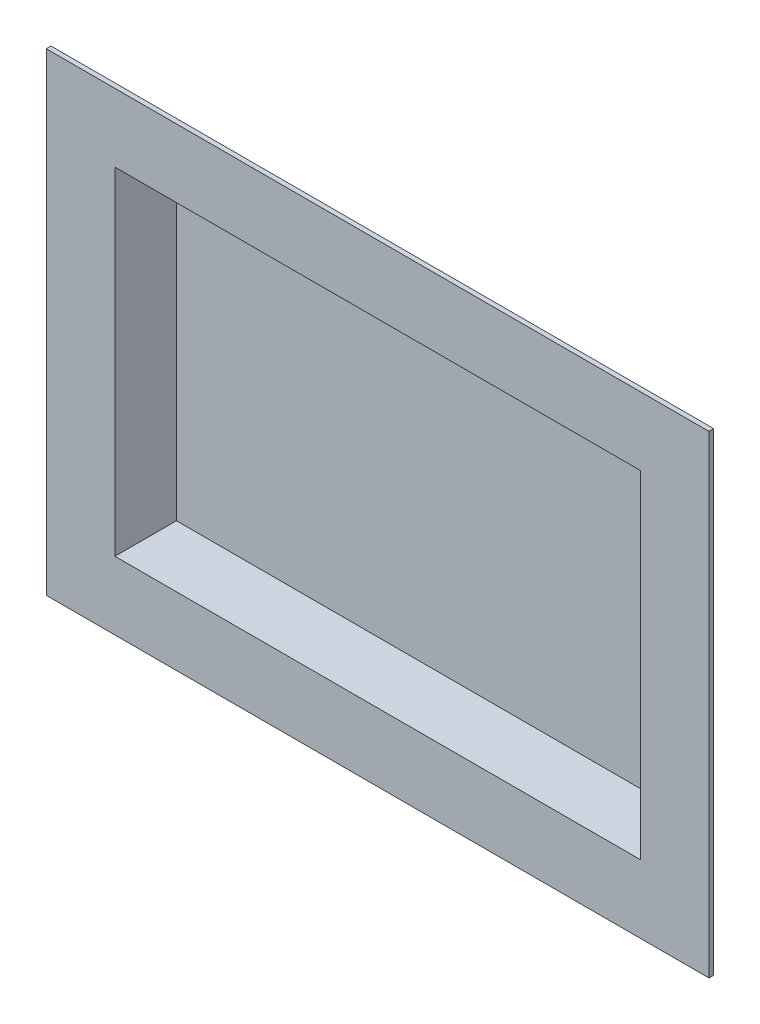
ISO-10303-21;
HEADER;
FILE_DESCRIPTION(('STEP AP214'),'2;1');
FILE_NAME('part.step','',(''),(''),'','','');
FILE_SCHEMA(('AUTOMOTIVE_DESIGN { 1 0 10303 214 1 1 1 1 }'));
ENDSEC;
DATA;
#1=APPLICATION_CONTEXT('core data for automotive mechanical design processes');
#2=APPLICATION_PROTOCOL_DEFINITION('international standard','automotive_design',2000,#1);
#3=PRODUCT_CONTEXT('',#1,'mechanical');
#4=PRODUCT('Part','Part','',(#3));
#5=PRODUCT_RELATED_PRODUCT_CATEGORY('part','',(#4));
#6=PRODUCT_DEFINITION_FORMATION('','',#4);
#7=PRODUCT_DEFINITION_CONTEXT('part definition',#1,'design');
#8=PRODUCT_DEFINITION('design','',#6,#7);
#9=PRODUCT_DEFINITION_SHAPE('','',#8);
#10=(LENGTH_UNIT() NAMED_UNIT(*) SI_UNIT(.MILLI.,.METRE.));
#11=(NAMED_UNIT(*) PLANE_ANGLE_UNIT() SI_UNIT($,.RADIAN.));
#12=(NAMED_UNIT(*) SI_UNIT($,.STERADIAN.) SOLID_ANGLE_UNIT());
#13=UNCERTAINTY_MEASURE_WITH_UNIT(LENGTH_MEASURE(1.E-05),#10,'distance_accuracy_value','');
#14=(GEOMETRIC_REPRESENTATION_CONTEXT(3) GLOBAL_UNCERTAINTY_ASSIGNED_CONTEXT((#13)) GLOBAL_UNIT_ASSIGNED_CONTEXT((#10,
#11,#12)) REPRESENTATION_CONTEXT('',''));
#15=CARTESIAN_POINT('',(0.,0.,0.));
#16=DIRECTION('',(0.,0.,1.));
#17=DIRECTION('',(1.,0.,0.));
#18=AXIS2_PLACEMENT_3D('',#15,#16,#17);
#19=CARTESIAN_POINT('',(0.,0.,1.27));
#20=DIRECTION('',(0.,0.,-1.));
#21=DIRECTION('',(-1.,0.,0.));
#22=AXIS2_PLACEMENT_3D('',#19,#20,#21);
#23=PLANE('',#22);
#24=DIRECTION('',(0.,1.,0.));
#25=VECTOR('',#24,1.);
#26=CARTESIAN_POINT('',(88.9,-63.5,1.27));
#27=LINE('',#26,#25);
#28=CARTESIAN_POINT('',(88.9,-63.5,1.27));
#29=VERTEX_POINT('',#28);
#30=CARTESIAN_POINT('',(88.9,63.5,1.27));
#31=VERTEX_POINT('',#30);
#32=EDGE_CURVE('E175',#29,#31,#27,.T.);
#33=ORIENTED_EDGE('',*,*,#32,.T.);
#34=DIRECTION('',(-1.,0.,0.));
#35=VECTOR('',#34,1.);
#36=CARTESIAN_POINT('',(-88.9,63.5,1.27));
#37=LINE('',#36,#35);
#38=CARTESIAN_POINT('',(-88.9,63.5,1.27));
#39=VERTEX_POINT('',#38);
#40=EDGE_CURVE('E178',#31,#39,#37,.T.);
#41=ORIENTED_EDGE('',*,*,#40,.T.);
#42=DIRECTION('',(0.,-1.,0.));
#43=VECTOR('',#42,1.);
#44=CARTESIAN_POINT('',(-88.9,-63.5,1.27));
#45=LINE('',#44,#43);
#46=CARTESIAN_POINT('',(-88.9,-63.5,1.27));
#47=VERTEX_POINT('',#46);
#48=EDGE_CURVE('E181',#39,#47,#45,.T.);
#49=ORIENTED_EDGE('',*,*,#48,.T.);
#50=DIRECTION('',(1.,0.,0.));
#51=VECTOR('',#50,1.);
#52=CARTESIAN_POINT('',(-88.9,-63.5,1.27));
#53=LINE('',#52,#51);
#54=EDGE_CURVE('E183',#47,#29,#53,.T.);
#55=ORIENTED_EDGE('',*,*,#54,.T.);
#56=EDGE_LOOP('',(#33,#41,#49,#55));
#57=FACE_BOUND('',#56,.T.);
#58=DIRECTION('',(-1.,0.,0.));
#59=VECTOR('',#58,1.);
#60=CARTESIAN_POINT('',(-71.755,45.212,1.27));
#61=LINE('',#60,#59);
#62=CARTESIAN_POINT('',(70.485,45.212,1.27));
#63=VERTEX_POINT('',#62);
#64=CARTESIAN_POINT('',(-70.485,45.212,1.27));
#65=VERTEX_POINT('',#64);
#66=EDGE_CURVE('E169',#63,#65,#61,.T.);
#67=ORIENTED_EDGE('',*,*,#66,.F.);
#68=DIRECTION('',(0.,1.,0.));
#69=VECTOR('',#68,1.);
#70=CARTESIAN_POINT('',(70.485,-46.482,1.27));
#71=LINE('',#70,#69);
#72=CARTESIAN_POINT('',(70.485,-45.212,1.27));
#73=VERTEX_POINT('',#72);
#74=EDGE_CURVE('E173',#73,#63,#71,.T.);
#75=ORIENTED_EDGE('',*,*,#74,.F.);
#76=DIRECTION('',(1.,0.,0.));
#77=VECTOR('',#76,1.);
#78=CARTESIAN_POINT('',(-71.755,-45.212,1.27));
#79=LINE('',#78,#77);
#80=CARTESIAN_POINT('',(-70.485,-45.212,1.27));
#81=VERTEX_POINT('',#80);
#82=EDGE_CURVE('E141',#81,#73,#79,.T.);
#83=ORIENTED_EDGE('',*,*,#82,.F.);
#84=DIRECTION('',(0.,-1.,0.));
#85=VECTOR('',#84,1.);
#86=CARTESIAN_POINT('',(-70.485,-46.482,1.27));
#87=LINE('',#86,#85);
#88=EDGE_CURVE('E167',#65,#81,#87,.T.);
#89=ORIENTED_EDGE('',*,*,#88,.F.);
#90=EDGE_LOOP('',(#67,#75,#83,#89));
#91=FACE_BOUND('',#90,.T.);
#92=ADVANCED_FACE('F39',(#57,#91),#23,.F.);
#93=CARTESIAN_POINT('',(71.755,-46.482,-16.51));
#94=DIRECTION('',(1.,0.,0.));
#95=DIRECTION('',(0.,0.,-1.));
#96=AXIS2_PLACEMENT_3D('',#93,#94,#95);
#97=PLANE('',#96);
#98=DIRECTION('',(0.,1.,0.));
#99=VECTOR('',#98,1.);
#100=CARTESIAN_POINT('',(71.755,-46.482,0.));
#101=LINE('',#100,#99);
#102=CARTESIAN_POINT('',(71.755,-46.482,0.));
#103=VERTEX_POINT('',#102);
#104=CARTESIAN_POINT('',(71.755,46.482,0.));
#105=VERTEX_POINT('',#104);
#106=EDGE_CURVE('E204',#103,#105,#101,.T.);
#107=ORIENTED_EDGE('',*,*,#106,.F.);
#108=DIRECTION('',(0.,0.,1.));
#109=VECTOR('',#108,1.);
#110=CARTESIAN_POINT('',(71.755,-46.482,-16.51));
#111=LINE('',#110,#109);
#112=CARTESIAN_POINT('',(71.755,-46.482,-16.51));
#113=VERTEX_POINT('',#112);
#114=EDGE_CURVE('E11',#113,#103,#111,.T.);
#115=ORIENTED_EDGE('',*,*,#114,.F.);
#116=DIRECTION('',(0.,1.,0.));
#117=VECTOR('',#116,1.);
#118=CARTESIAN_POINT('',(71.755,-46.482,-16.51));
#119=LINE('',#118,#117);
#120=CARTESIAN_POINT('',(71.755,46.482,-16.51));
#121=VERTEX_POINT('',#120);
#122=EDGE_CURVE('E205',#113,#121,#119,.T.);
#123=ORIENTED_EDGE('',*,*,#122,.T.);
#124=DIRECTION('',(0.,0.,1.));
#125=VECTOR('',#124,1.);
#126=CARTESIAN_POINT('',(71.755,46.482,-16.51));
#127=LINE('',#126,#125);
#128=EDGE_CURVE('E43',#121,#105,#127,.T.);
#129=ORIENTED_EDGE('',*,*,#128,.T.);
#130=EDGE_LOOP('',(#107,#115,#123,#129));
#131=FACE_BOUND('',#130,.T.);
#132=ADVANCED_FACE('F41',(#131),#97,.T.);
#133=CARTESIAN_POINT('',(-71.755,-46.482,-16.51));
#134=DIRECTION('',(0.,-1.,0.));
#135=DIRECTION('',(0.,0.,-1.));
#136=AXIS2_PLACEMENT_3D('',#133,#134,#135);
#137=PLANE('',#136);
#138=DIRECTION('',(1.,0.,0.));
#139=VECTOR('',#138,1.);
#140=CARTESIAN_POINT('',(-71.755,-46.482,0.));
#141=LINE('',#140,#139);
#142=CARTESIAN_POINT('',(-71.755,-46.482,0.));
#143=VERTEX_POINT('',#142);
#144=EDGE_CURVE('E208',#143,#103,#141,.T.);
#145=ORIENTED_EDGE('',*,*,#144,.F.);
#146=DIRECTION('',(0.,0.,1.));
#147=VECTOR('',#146,1.);
#148=CARTESIAN_POINT('',(-71.755,-46.482,-16.51));
#149=LINE('',#148,#147);
#150=CARTESIAN_POINT('',(-71.755,-46.482,-16.51));
#151=VERTEX_POINT('',#150);
#152=EDGE_CURVE('E48',#151,#143,#149,.T.);
#153=ORIENTED_EDGE('',*,*,#152,.F.);
#154=DIRECTION('',(1.,0.,0.));
#155=VECTOR('',#154,1.);
#156=CARTESIAN_POINT('',(-71.755,-46.482,-16.51));
#157=LINE('',#156,#155);
#158=EDGE_CURVE('E212',#151,#113,#157,.T.);
#159=ORIENTED_EDGE('',*,*,#158,.T.);
#160=ORIENTED_EDGE('',*,*,#114,.T.);
#161=EDGE_LOOP('',(#145,#153,#159,#160));
#162=FACE_BOUND('',#161,.T.);
#163=ADVANCED_FACE('F231',(#162),#137,.T.);
#164=CARTESIAN_POINT('',(-71.755,-46.482,-16.51));
#165=DIRECTION('',(-1.,0.,0.));
#166=DIRECTION('',(0.,0.,1.));
#167=AXIS2_PLACEMENT_3D('',#164,#165,#166);
#168=PLANE('',#167);
#169=DIRECTION('',(0.,-1.,0.));
#170=VECTOR('',#169,1.);
#171=CARTESIAN_POINT('',(-71.755,-46.482,0.));
#172=LINE('',#171,#170);
#173=CARTESIAN_POINT('',(-71.755,46.482,0.));
#174=VERTEX_POINT('',#173);
#175=EDGE_CURVE('E220',#174,#143,#172,.T.);
#176=ORIENTED_EDGE('',*,*,#175,.F.);
#177=DIRECTION('',(0.,0.,1.));
#178=VECTOR('',#177,1.);
#179=CARTESIAN_POINT('',(-71.755,46.482,-16.51));
#180=LINE('',#179,#178);
#181=CARTESIAN_POINT('',(-71.755,46.482,-16.51));
#182=VERTEX_POINT('',#181);
#183=EDGE_CURVE('E225',#182,#174,#180,.T.);
#184=ORIENTED_EDGE('',*,*,#183,.F.);
#185=DIRECTION('',(0.,-1.,0.));
#186=VECTOR('',#185,1.);
#187=CARTESIAN_POINT('',(-71.755,-46.482,-16.51));
#188=LINE('',#187,#186);
#189=EDGE_CURVE('E210',#182,#151,#188,.T.);
#190=ORIENTED_EDGE('',*,*,#189,.T.);
#191=ORIENTED_EDGE('',*,*,#152,.T.);
#192=EDGE_LOOP('',(#176,#184,#190,#191));
#193=FACE_BOUND('',#192,.T.);
#194=ADVANCED_FACE('F236',(#193),#168,.T.);
#195=CARTESIAN_POINT('',(-71.755,46.482,-16.51));
#196=DIRECTION('',(0.,1.,0.));
#197=DIRECTION('',(0.,0.,1.));
#198=AXIS2_PLACEMENT_3D('',#195,#196,#197);
#199=PLANE('',#198);
#200=DIRECTION('',(-1.,0.,0.));
#201=VECTOR('',#200,1.);
#202=CARTESIAN_POINT('',(-71.755,46.482,0.));
#203=LINE('',#202,#201);
#204=EDGE_CURVE('E217',#105,#174,#203,.T.);
#205=ORIENTED_EDGE('',*,*,#204,.F.);
#206=ORIENTED_EDGE('',*,*,#128,.F.);
#207=DIRECTION('',(-1.,0.,0.));
#208=VECTOR('',#207,1.);
#209=CARTESIAN_POINT('',(-71.755,46.482,-16.51));
#210=LINE('',#209,#208);
#211=EDGE_CURVE('E207',#121,#182,#210,.T.);
#212=ORIENTED_EDGE('',*,*,#211,.T.);
#213=ORIENTED_EDGE('',*,*,#183,.T.);
#214=EDGE_LOOP('',(#205,#206,#212,#213));
#215=FACE_BOUND('',#214,.T.);
#216=ADVANCED_FACE('F226',(#215),#199,.T.);
#217=CARTESIAN_POINT('',(0.,0.,-16.51));
#218=DIRECTION('',(0.,0.,-1.));
#219=DIRECTION('',(-1.,0.,0.));
#220=AXIS2_PLACEMENT_3D('',#217,#218,#219);
#221=PLANE('',#220);
#222=ORIENTED_EDGE('',*,*,#122,.F.);
#223=ORIENTED_EDGE('',*,*,#158,.F.);
#224=ORIENTED_EDGE('',*,*,#189,.F.);
#225=ORIENTED_EDGE('',*,*,#211,.F.);
#226=EDGE_LOOP('',(#222,#223,#224,#225));
#227=FACE_BOUND('',#226,.T.);
#228=ADVANCED_FACE('F235',(#227),#221,.T.);
#229=CARTESIAN_POINT('',(88.9,-63.5,1.27));
#230=DIRECTION('',(-1.,0.,0.));
#231=DIRECTION('',(0.,0.,1.));
#232=AXIS2_PLACEMENT_3D('',#229,#230,#231);
#233=PLANE('',#232);
#234=DIRECTION('',(0.,1.,0.));
#235=VECTOR('',#234,1.);
#236=CARTESIAN_POINT('',(88.9,-63.5,0.));
#237=LINE('',#236,#235);
#238=CARTESIAN_POINT('',(88.9,-63.5,0.));
#239=VERTEX_POINT('',#238);
#240=CARTESIAN_POINT('',(88.9,63.5,0.));
#241=VERTEX_POINT('',#240);
#242=EDGE_CURVE('E143',#239,#241,#237,.T.);
#243=ORIENTED_EDGE('',*,*,#242,.T.);
#244=DIRECTION('',(0.,0.,-1.));
#245=VECTOR('',#244,1.);
#246=CARTESIAN_POINT('',(88.9,63.5,1.27));
#247=LINE('',#246,#245);
#248=EDGE_CURVE('E201',#31,#241,#247,.T.);
#249=ORIENTED_EDGE('',*,*,#248,.F.);
#250=ORIENTED_EDGE('',*,*,#32,.F.);
#251=DIRECTION('',(0.,0.,-1.));
#252=VECTOR('',#251,1.);
#253=CARTESIAN_POINT('',(88.9,-63.5,1.27));
#254=LINE('',#253,#252);
#255=EDGE_CURVE('E185',#29,#239,#254,.T.);
#256=ORIENTED_EDGE('',*,*,#255,.T.);
#257=EDGE_LOOP('',(#243,#249,#250,#256));
#258=FACE_BOUND('',#257,.T.);
#259=ADVANCED_FACE('F268',(#258),#233,.F.);
#260=CARTESIAN_POINT('',(-88.9,63.5,1.27));
#261=DIRECTION('',(0.,-1.,0.));
#262=DIRECTION('',(0.,0.,-1.));
#263=AXIS2_PLACEMENT_3D('',#260,#261,#262);
#264=PLANE('',#263);
#265=DIRECTION('',(-1.,0.,0.));
#266=VECTOR('',#265,1.);
#267=CARTESIAN_POINT('',(-88.9,63.5,0.));
#268=LINE('',#267,#266);
#269=CARTESIAN_POINT('',(-88.9,63.5,0.));
#270=VERTEX_POINT('',#269);
#271=EDGE_CURVE('E188',#241,#270,#268,.T.);
#272=ORIENTED_EDGE('',*,*,#271,.T.);
#273=DIRECTION('',(0.,0.,-1.));
#274=VECTOR('',#273,1.);
#275=CARTESIAN_POINT('',(-88.9,63.5,1.27));
#276=LINE('',#275,#274);
#277=EDGE_CURVE('E198',#39,#270,#276,.T.);
#278=ORIENTED_EDGE('',*,*,#277,.F.);
#279=ORIENTED_EDGE('',*,*,#40,.F.);
#280=ORIENTED_EDGE('',*,*,#248,.T.);
#281=EDGE_LOOP('',(#272,#278,#279,#280));
#282=FACE_BOUND('',#281,.T.);
#283=ADVANCED_FACE('F264',(#282),#264,.F.);
#284=CARTESIAN_POINT('',(-88.9,-63.5,1.27));
#285=DIRECTION('',(1.,0.,0.));
#286=DIRECTION('',(0.,0.,-1.));
#287=AXIS2_PLACEMENT_3D('',#284,#285,#286);
#288=PLANE('',#287);
#289=DIRECTION('',(0.,-1.,0.));
#290=VECTOR('',#289,1.);
#291=CARTESIAN_POINT('',(-88.9,-63.5,0.));
#292=LINE('',#291,#290);
#293=CARTESIAN_POINT('',(-88.9,-63.5,0.));
#294=VERTEX_POINT('',#293);
#295=EDGE_CURVE('E190',#270,#294,#292,.T.);
#296=ORIENTED_EDGE('',*,*,#295,.T.);
#297=DIRECTION('',(0.,0.,-1.));
#298=VECTOR('',#297,1.);
#299=CARTESIAN_POINT('',(-88.9,-63.5,1.27));
#300=LINE('',#299,#298);
#301=EDGE_CURVE('E195',#47,#294,#300,.T.);
#302=ORIENTED_EDGE('',*,*,#301,.F.);
#303=ORIENTED_EDGE('',*,*,#48,.F.);
#304=ORIENTED_EDGE('',*,*,#277,.T.);
#305=EDGE_LOOP('',(#296,#302,#303,#304));
#306=FACE_BOUND('',#305,.T.);
#307=ADVANCED_FACE('F260',(#306),#288,.F.);
#308=CARTESIAN_POINT('',(-88.9,-63.5,1.27));
#309=DIRECTION('',(0.,1.,0.));
#310=DIRECTION('',(0.,0.,1.));
#311=AXIS2_PLACEMENT_3D('',#308,#309,#310);
#312=PLANE('',#311);
#313=DIRECTION('',(1.,0.,0.));
#314=VECTOR('',#313,1.);
#315=CARTESIAN_POINT('',(-88.9,-63.5,0.));
#316=LINE('',#315,#314);
#317=EDGE_CURVE('E179',#294,#239,#316,.T.);
#318=ORIENTED_EDGE('',*,*,#317,.T.);
#319=ORIENTED_EDGE('',*,*,#255,.F.);
#320=ORIENTED_EDGE('',*,*,#54,.F.);
#321=ORIENTED_EDGE('',*,*,#301,.T.);
#322=EDGE_LOOP('',(#318,#319,#320,#321));
#323=FACE_BOUND('',#322,.T.);
#324=ADVANCED_FACE('F257',(#323),#312,.F.);
#325=CARTESIAN_POINT('',(0.,0.,0.));
#326=DIRECTION('',(0.,0.,-1.));
#327=DIRECTION('',(-1.,0.,0.));
#328=AXIS2_PLACEMENT_3D('',#325,#326,#327);
#329=PLANE('',#328);
#330=ORIENTED_EDGE('',*,*,#144,.T.);
#331=ORIENTED_EDGE('',*,*,#106,.T.);
#332=ORIENTED_EDGE('',*,*,#204,.T.);
#333=ORIENTED_EDGE('',*,*,#175,.T.);
#334=EDGE_LOOP('',(#330,#331,#332,#333));
#335=FACE_BOUND('',#334,.T.);
#336=ORIENTED_EDGE('',*,*,#242,.F.);
#337=ORIENTED_EDGE('',*,*,#317,.F.);
#338=ORIENTED_EDGE('',*,*,#295,.F.);
#339=ORIENTED_EDGE('',*,*,#271,.F.);
#340=EDGE_LOOP('',(#336,#337,#338,#339));
#341=FACE_BOUND('',#340,.T.);
#342=ADVANCED_FACE('F228',(#335,#341),#329,.T.);
#343=CARTESIAN_POINT('',(70.485,-46.482,-16.51));
#344=DIRECTION('',(1.,0.,0.));
#345=DIRECTION('',(0.,0.,-1.));
#346=AXIS2_PLACEMENT_3D('',#343,#344,#345);
#347=PLANE('',#346);
#348=ORIENTED_EDGE('',*,*,#74,.T.);
#349=DIRECTION('',(0.,0.,1.));
#350=VECTOR('',#349,1.);
#351=CARTESIAN_POINT('',(70.485,45.212,-16.51));
#352=LINE('',#351,#350);
#353=CARTESIAN_POINT('',(70.485,45.212,-15.24));
#354=VERTEX_POINT('',#353);
#355=EDGE_CURVE('E150',#354,#63,#352,.T.);
#356=ORIENTED_EDGE('',*,*,#355,.F.);
#357=DIRECTION('',(0.,1.,0.));
#358=VECTOR('',#357,1.);
#359=CARTESIAN_POINT('',(70.485,-46.482,-15.24));
#360=LINE('',#359,#358);
#361=CARTESIAN_POINT('',(70.485,-45.212,-15.24));
#362=VERTEX_POINT('',#361);
#363=EDGE_CURVE('E147',#362,#354,#360,.T.);
#364=ORIENTED_EDGE('',*,*,#363,.F.);
#365=DIRECTION('',(0.,0.,1.));
#366=VECTOR('',#365,1.);
#367=CARTESIAN_POINT('',(70.485,-45.212,-16.51));
#368=LINE('',#367,#366);
#369=EDGE_CURVE('E56',#362,#73,#368,.T.);
#370=ORIENTED_EDGE('',*,*,#369,.T.);
#371=EDGE_LOOP('',(#348,#356,#364,#370));
#372=FACE_BOUND('',#371,.T.);
#373=ADVANCED_FACE('F148',(#372),#347,.F.);
#374=CARTESIAN_POINT('',(-71.755,-45.212,-16.51));
#375=DIRECTION('',(0.,-1.,0.));
#376=DIRECTION('',(0.,0.,-1.));
#377=AXIS2_PLACEMENT_3D('',#374,#375,#376);
#378=PLANE('',#377);
#379=ORIENTED_EDGE('',*,*,#82,.T.);
#380=ORIENTED_EDGE('',*,*,#369,.F.);
#381=DIRECTION('',(1.,0.,0.));
#382=VECTOR('',#381,1.);
#383=CARTESIAN_POINT('',(-71.755,-45.212,-15.24));
#384=LINE('',#383,#382);
#385=CARTESIAN_POINT('',(-70.485,-45.212,-15.24));
#386=VERTEX_POINT('',#385);
#387=EDGE_CURVE('E139',#386,#362,#384,.T.);
#388=ORIENTED_EDGE('',*,*,#387,.F.);
#389=DIRECTION('',(0.,0.,1.));
#390=VECTOR('',#389,1.);
#391=CARTESIAN_POINT('',(-70.485,-45.212,-16.51));
#392=LINE('',#391,#390);
#393=EDGE_CURVE('E144',#386,#81,#392,.T.);
#394=ORIENTED_EDGE('',*,*,#393,.T.);
#395=EDGE_LOOP('',(#379,#380,#388,#394));
#396=FACE_BOUND('',#395,.T.);
#397=ADVANCED_FACE('F136',(#396),#378,.F.);
#398=CARTESIAN_POINT('',(-70.485,-46.482,-16.51));
#399=DIRECTION('',(-1.,0.,0.));
#400=DIRECTION('',(0.,0.,1.));
#401=AXIS2_PLACEMENT_3D('',#398,#399,#400);
#402=PLANE('',#401);
#403=ORIENTED_EDGE('',*,*,#88,.T.);
#404=ORIENTED_EDGE('',*,*,#393,.F.);
#405=DIRECTION('',(0.,-1.,0.));
#406=VECTOR('',#405,1.);
#407=CARTESIAN_POINT('',(-70.485,-46.482,-15.24));
#408=LINE('',#407,#406);
#409=CARTESIAN_POINT('',(-70.485,45.212,-15.24));
#410=VERTEX_POINT('',#409);
#411=EDGE_CURVE('E159',#410,#386,#408,.T.);
#412=ORIENTED_EDGE('',*,*,#411,.F.);
#413=DIRECTION('',(0.,0.,1.));
#414=VECTOR('',#413,1.);
#415=CARTESIAN_POINT('',(-70.485,45.212,-16.51));
#416=LINE('',#415,#414);
#417=EDGE_CURVE('E161',#410,#65,#416,.T.);
#418=ORIENTED_EDGE('',*,*,#417,.T.);
#419=EDGE_LOOP('',(#403,#404,#412,#418));
#420=FACE_BOUND('',#419,.T.);
#421=ADVANCED_FACE('F343',(#420),#402,.F.);
#422=CARTESIAN_POINT('',(-71.755,45.212,-16.51));
#423=DIRECTION('',(0.,1.,0.));
#424=DIRECTION('',(0.,0.,1.));
#425=AXIS2_PLACEMENT_3D('',#422,#423,#424);
#426=PLANE('',#425);
#427=ORIENTED_EDGE('',*,*,#66,.T.);
#428=ORIENTED_EDGE('',*,*,#417,.F.);
#429=DIRECTION('',(-1.,0.,0.));
#430=VECTOR('',#429,1.);
#431=CARTESIAN_POINT('',(-71.755,45.212,-15.24));
#432=LINE('',#431,#430);
#433=EDGE_CURVE('E154',#354,#410,#432,.T.);
#434=ORIENTED_EDGE('',*,*,#433,.F.);
#435=ORIENTED_EDGE('',*,*,#355,.T.);
#436=EDGE_LOOP('',(#427,#428,#434,#435));
#437=FACE_BOUND('',#436,.T.);
#438=ADVANCED_FACE('F352',(#437),#426,.F.);
#439=CARTESIAN_POINT('',(0.,0.,-15.24));
#440=DIRECTION('',(0.,0.,-1.));
#441=DIRECTION('',(-1.,0.,0.));
#442=AXIS2_PLACEMENT_3D('',#439,#440,#441);
#443=PLANE('',#442);
#444=ORIENTED_EDGE('',*,*,#363,.T.);
#445=ORIENTED_EDGE('',*,*,#433,.T.);
#446=ORIENTED_EDGE('',*,*,#411,.T.);
#447=ORIENTED_EDGE('',*,*,#387,.T.);
#448=EDGE_LOOP('',(#444,#445,#446,#447));
#449=FACE_BOUND('',#448,.T.);
#450=ADVANCED_FACE('F157',(#449),#443,.F.);
#451=CLOSED_SHELL('',(#92,#132,#163,#194,#216,#228,#259,#283,#307,#324,#342,#373,#397,#421,#438,#450));
#452=MANIFOLD_SOLID_BREP('B2',#451);
#453=ADVANCED_BREP_SHAPE_REPRESENTATION('',(#18,#452),#14);
#454=SHAPE_DEFINITION_REPRESENTATION(#9,#453);
ENDSEC;
END-ISO-10303-21;
